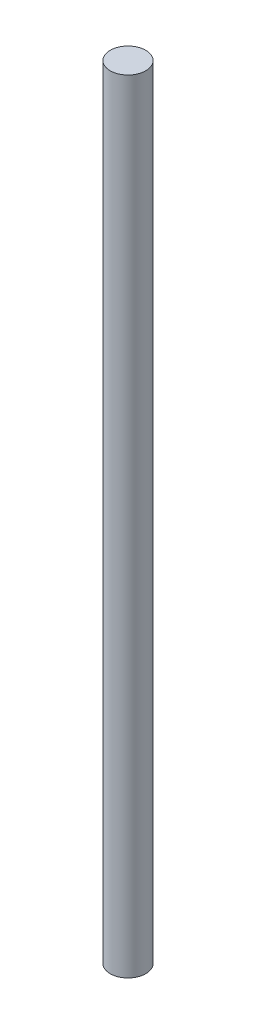
ISO-10303-21;
HEADER;
FILE_DESCRIPTION(('STEP AP214'),'2;1');
FILE_NAME('part.step','',(''),(''),'','','');
FILE_SCHEMA(('AUTOMOTIVE_DESIGN { 1 0 10303 214 1 1 1 1 }'));
ENDSEC;
DATA;
#1=APPLICATION_CONTEXT('core data for automotive mechanical design processes');
#2=APPLICATION_PROTOCOL_DEFINITION('international standard','automotive_design',2000,#1);
#3=PRODUCT_CONTEXT('',#1,'mechanical');
#4=PRODUCT('Part','Part','',(#3));
#5=PRODUCT_RELATED_PRODUCT_CATEGORY('part','',(#4));
#6=PRODUCT_DEFINITION_FORMATION('','',#4);
#7=PRODUCT_DEFINITION_CONTEXT('part definition',#1,'design');
#8=PRODUCT_DEFINITION('design','',#6,#7);
#9=PRODUCT_DEFINITION_SHAPE('','',#8);
#10=(LENGTH_UNIT() NAMED_UNIT(*) SI_UNIT(.MILLI.,.METRE.));
#11=(NAMED_UNIT(*) PLANE_ANGLE_UNIT() SI_UNIT($,.RADIAN.));
#12=(NAMED_UNIT(*) SI_UNIT($,.STERADIAN.) SOLID_ANGLE_UNIT());
#13=UNCERTAINTY_MEASURE_WITH_UNIT(LENGTH_MEASURE(1.E-05),#10,'distance_accuracy_value','');
#14=(GEOMETRIC_REPRESENTATION_CONTEXT(3) GLOBAL_UNCERTAINTY_ASSIGNED_CONTEXT((#13)) GLOBAL_UNIT_ASSIGNED_CONTEXT((#10,
#11,#12)) REPRESENTATION_CONTEXT('',''));
#15=CARTESIAN_POINT('',(0.,0.,0.));
#16=DIRECTION('',(0.,0.,1.));
#17=DIRECTION('',(1.,0.,0.));
#18=AXIS2_PLACEMENT_3D('',#15,#16,#17);
#19=CARTESIAN_POINT('',(0.,110.,0.));
#20=DIRECTION('',(0.,-1.,0.));
#21=DIRECTION('',(0.,0.,-1.));
#22=AXIS2_PLACEMENT_3D('',#19,#20,#21);
#23=CYLINDRICAL_SURFACE('',#22,2.5);
#24=CARTESIAN_POINT('',(0.,110.,0.));
#25=DIRECTION('',(0.,1.,0.));
#26=DIRECTION('',(0.,0.,1.));
#27=AXIS2_PLACEMENT_3D('',#24,#25,#26);
#28=CIRCLE('',#27,2.5);
#29=CARTESIAN_POINT('',(0.,110.,2.5));
#30=VERTEX_POINT('',#29);
#31=EDGE_CURVE('E10',#30,#30,#28,.T.);
#32=ORIENTED_EDGE('',*,*,#31,.F.);
#33=EDGE_LOOP('',(#32));
#34=FACE_BOUND('',#33,.T.);
#35=CARTESIAN_POINT('',(0.,0.,0.));
#36=DIRECTION('',(0.,1.,0.));
#37=DIRECTION('',(0.,0.,1.));
#38=AXIS2_PLACEMENT_3D('',#35,#36,#37);
#39=CIRCLE('',#38,2.5);
#40=CARTESIAN_POINT('',(0.,0.,2.5));
#41=VERTEX_POINT('',#40);
#42=EDGE_CURVE('E35',#41,#41,#39,.T.);
#43=ORIENTED_EDGE('',*,*,#42,.T.);
#44=EDGE_LOOP('',(#43));
#45=FACE_BOUND('',#44,.T.);
#46=ADVANCED_FACE('F32',(#34,#45),#23,.T.);
#47=CARTESIAN_POINT('',(0.,110.,0.));
#48=DIRECTION('',(0.,1.,0.));
#49=DIRECTION('',(0.,0.,1.));
#50=AXIS2_PLACEMENT_3D('',#47,#48,#49);
#51=PLANE('',#50);
#52=ORIENTED_EDGE('',*,*,#31,.T.);
#53=EDGE_LOOP('',(#52));
#54=FACE_BOUND('',#53,.T.);
#55=ADVANCED_FACE('F47',(#54),#51,.T.);
#56=CARTESIAN_POINT('',(0.,0.,0.));
#57=DIRECTION('',(0.,1.,0.));
#58=DIRECTION('',(0.,0.,1.));
#59=AXIS2_PLACEMENT_3D('',#56,#57,#58);
#60=PLANE('',#59);
#61=ORIENTED_EDGE('',*,*,#42,.F.);
#62=EDGE_LOOP('',(#61));
#63=FACE_BOUND('',#62,.T.);
#64=ADVANCED_FACE('F45',(#63),#60,.F.);
#65=CLOSED_SHELL('',(#46,#55,#64));
#66=MANIFOLD_SOLID_BREP('B2',#65);
#67=ADVANCED_BREP_SHAPE_REPRESENTATION('',(#18,#66),#14);
#68=SHAPE_DEFINITION_REPRESENTATION(#9,#67);
ENDSEC;
END-ISO-10303-21;
